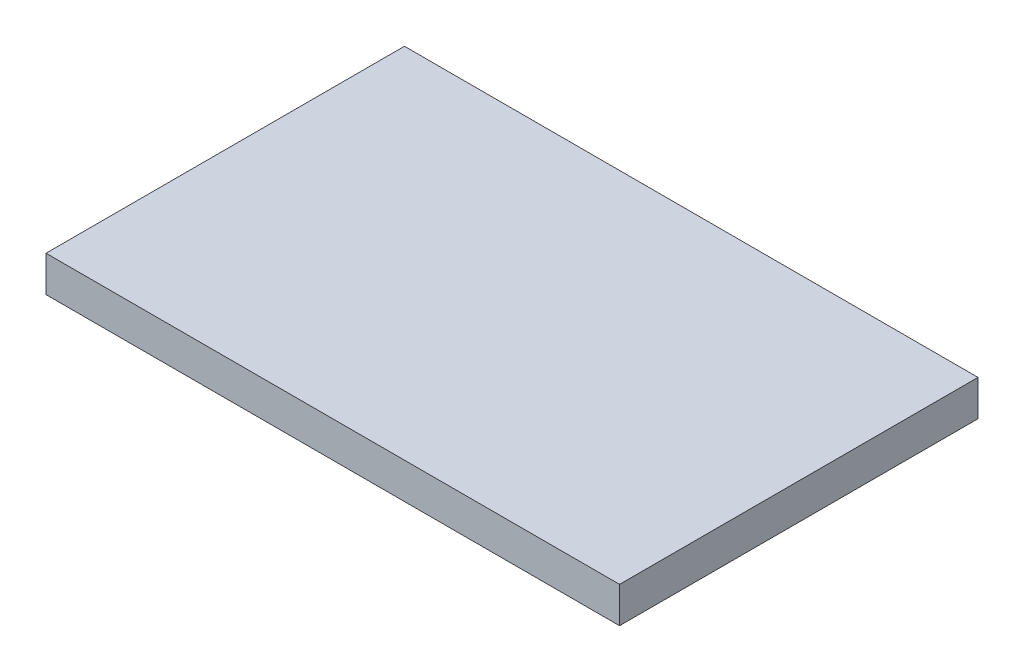
ISO-10303-21;
HEADER;
FILE_DESCRIPTION(('STEP AP214'),'2;1');
FILE_NAME('part.step','',(''),(''),'','','');
FILE_SCHEMA(('AUTOMOTIVE_DESIGN { 1 0 10303 214 1 1 1 1 }'));
ENDSEC;
DATA;
#1=APPLICATION_CONTEXT('core data for automotive mechanical design processes');
#2=APPLICATION_PROTOCOL_DEFINITION('international standard','automotive_design',2000,#1);
#3=PRODUCT_CONTEXT('',#1,'mechanical');
#4=PRODUCT('Part','Part','',(#3));
#5=PRODUCT_RELATED_PRODUCT_CATEGORY('part','',(#4));
#6=PRODUCT_DEFINITION_FORMATION('','',#4);
#7=PRODUCT_DEFINITION_CONTEXT('part definition',#1,'design');
#8=PRODUCT_DEFINITION('design','',#6,#7);
#9=PRODUCT_DEFINITION_SHAPE('','',#8);
#10=(LENGTH_UNIT() NAMED_UNIT(*) SI_UNIT(.MILLI.,.METRE.));
#11=(NAMED_UNIT(*) PLANE_ANGLE_UNIT() SI_UNIT($,.RADIAN.));
#12=(NAMED_UNIT(*) SI_UNIT($,.STERADIAN.) SOLID_ANGLE_UNIT());
#13=UNCERTAINTY_MEASURE_WITH_UNIT(LENGTH_MEASURE(1.E-05),#10,'distance_accuracy_value','');
#14=(GEOMETRIC_REPRESENTATION_CONTEXT(3) GLOBAL_UNCERTAINTY_ASSIGNED_CONTEXT((#13)) GLOBAL_UNIT_ASSIGNED_CONTEXT((#10,
#11,#12)) REPRESENTATION_CONTEXT('',''));
#15=CARTESIAN_POINT('',(0.,0.,0.));
#16=DIRECTION('',(0.,0.,1.));
#17=DIRECTION('',(1.,0.,0.));
#18=AXIS2_PLACEMENT_3D('',#15,#16,#17);
#19=CARTESIAN_POINT('',(0.,-12.7,127.));
#20=DIRECTION('',(1.,0.,0.));
#21=DIRECTION('',(0.,0.,-1.));
#22=AXIS2_PLACEMENT_3D('',#19,#20,#21);
#23=PLANE('',#22);
#24=DIRECTION('',(0.,-1.,0.));
#25=VECTOR('',#24,1.);
#26=CARTESIAN_POINT('',(0.,-12.7,0.));
#27=LINE('',#26,#25);
#28=CARTESIAN_POINT('',(0.,0.,0.));
#29=VERTEX_POINT('',#28);
#30=CARTESIAN_POINT('',(0.,-12.7,0.));
#31=VERTEX_POINT('',#30);
#32=EDGE_CURVE('E107',#29,#31,#27,.T.);
#33=ORIENTED_EDGE('',*,*,#32,.T.);
#34=DIRECTION('',(0.,0.,-1.));
#35=VECTOR('',#34,1.);
#36=CARTESIAN_POINT('',(0.,-12.7,127.));
#37=LINE('',#36,#35);
#38=CARTESIAN_POINT('',(0.,-12.7,127.));
#39=VERTEX_POINT('',#38);
#40=EDGE_CURVE('E11',#39,#31,#37,.T.);
#41=ORIENTED_EDGE('',*,*,#40,.F.);
#42=DIRECTION('',(0.,-1.,0.));
#43=VECTOR('',#42,1.);
#44=CARTESIAN_POINT('',(0.,-12.7,127.));
#45=LINE('',#44,#43);
#46=CARTESIAN_POINT('',(0.,0.,127.));
#47=VERTEX_POINT('',#46);
#48=EDGE_CURVE('E91',#47,#39,#45,.T.);
#49=ORIENTED_EDGE('',*,*,#48,.F.);
#50=DIRECTION('',(0.,0.,-1.));
#51=VECTOR('',#50,1.);
#52=CARTESIAN_POINT('',(0.,0.,127.));
#53=LINE('',#52,#51);
#54=EDGE_CURVE('E103',#47,#29,#53,.T.);
#55=ORIENTED_EDGE('',*,*,#54,.T.);
#56=EDGE_LOOP('',(#33,#41,#49,#55));
#57=FACE_BOUND('',#56,.T.);
#58=ADVANCED_FACE('F39',(#57),#23,.F.);
#59=CARTESIAN_POINT('',(203.2,-12.7,127.));
#60=DIRECTION('',(0.,1.,0.));
#61=DIRECTION('',(-1.,0.,0.));
#62=AXIS2_PLACEMENT_3D('',#59,#60,#61);
#63=PLANE('',#62);
#64=DIRECTION('',(1.,0.,0.));
#65=VECTOR('',#64,1.);
#66=CARTESIAN_POINT('',(203.2,-12.7,0.));
#67=LINE('',#66,#65);
#68=CARTESIAN_POINT('',(203.2,-12.7,0.));
#69=VERTEX_POINT('',#68);
#70=EDGE_CURVE('E96',#31,#69,#67,.T.);
#71=ORIENTED_EDGE('',*,*,#70,.T.);
#72=DIRECTION('',(0.,0.,-1.));
#73=VECTOR('',#72,1.);
#74=CARTESIAN_POINT('',(203.2,-12.7,127.));
#75=LINE('',#74,#73);
#76=CARTESIAN_POINT('',(203.2,-12.7,127.));
#77=VERTEX_POINT('',#76);
#78=EDGE_CURVE('E48',#77,#69,#75,.T.);
#79=ORIENTED_EDGE('',*,*,#78,.F.);
#80=DIRECTION('',(1.,0.,0.));
#81=VECTOR('',#80,1.);
#82=CARTESIAN_POINT('',(203.2,-12.7,127.));
#83=LINE('',#82,#81);
#84=EDGE_CURVE('E86',#39,#77,#83,.T.);
#85=ORIENTED_EDGE('',*,*,#84,.F.);
#86=ORIENTED_EDGE('',*,*,#40,.T.);
#87=EDGE_LOOP('',(#71,#79,#85,#86));
#88=FACE_BOUND('',#87,.T.);
#89=ADVANCED_FACE('F95',(#88),#63,.F.);
#90=CARTESIAN_POINT('',(203.2,0.,127.));
#91=DIRECTION('',(-1.,0.,0.));
#92=DIRECTION('',(0.,0.,1.));
#93=AXIS2_PLACEMENT_3D('',#90,#91,#92);
#94=PLANE('',#93);
#95=DIRECTION('',(0.,1.,0.));
#96=VECTOR('',#95,1.);
#97=CARTESIAN_POINT('',(203.2,0.,0.));
#98=LINE('',#97,#96);
#99=CARTESIAN_POINT('',(203.2,0.,0.));
#100=VERTEX_POINT('',#99);
#101=EDGE_CURVE('E73',#69,#100,#98,.T.);
#102=ORIENTED_EDGE('',*,*,#101,.T.);
#103=DIRECTION('',(0.,0.,-1.));
#104=VECTOR('',#103,1.);
#105=CARTESIAN_POINT('',(203.2,0.,127.));
#106=LINE('',#105,#104);
#107=CARTESIAN_POINT('',(203.2,0.,127.));
#108=VERTEX_POINT('',#107);
#109=EDGE_CURVE('E98',#108,#100,#106,.T.);
#110=ORIENTED_EDGE('',*,*,#109,.F.);
#111=DIRECTION('',(0.,1.,0.));
#112=VECTOR('',#111,1.);
#113=CARTESIAN_POINT('',(203.2,0.,127.));
#114=LINE('',#113,#112);
#115=EDGE_CURVE('E89',#77,#108,#114,.T.);
#116=ORIENTED_EDGE('',*,*,#115,.F.);
#117=ORIENTED_EDGE('',*,*,#78,.T.);
#118=EDGE_LOOP('',(#102,#110,#116,#117));
#119=FACE_BOUND('',#118,.T.);
#120=ADVANCED_FACE('F99',(#119),#94,.F.);
#121=CARTESIAN_POINT('',(0.,0.,127.));
#122=DIRECTION('',(0.,-1.,0.));
#123=DIRECTION('',(0.,0.,-1.));
#124=AXIS2_PLACEMENT_3D('',#121,#122,#123);
#125=PLANE('',#124);
#126=DIRECTION('',(-1.,0.,0.));
#127=VECTOR('',#126,1.);
#128=CARTESIAN_POINT('',(0.,0.,0.));
#129=LINE('',#128,#127);
#130=EDGE_CURVE('E79',#100,#29,#129,.T.);
#131=ORIENTED_EDGE('',*,*,#130,.T.);
#132=ORIENTED_EDGE('',*,*,#54,.F.);
#133=DIRECTION('',(-1.,0.,0.));
#134=VECTOR('',#133,1.);
#135=CARTESIAN_POINT('',(0.,0.,127.));
#136=LINE('',#135,#134);
#137=EDGE_CURVE('E56',#108,#47,#136,.T.);
#138=ORIENTED_EDGE('',*,*,#137,.F.);
#139=ORIENTED_EDGE('',*,*,#109,.T.);
#140=EDGE_LOOP('',(#131,#132,#138,#139));
#141=FACE_BOUND('',#140,.T.);
#142=ADVANCED_FACE('F120',(#141),#125,.F.);
#143=CARTESIAN_POINT('',(0.,0.,127.));
#144=DIRECTION('',(0.,0.,-1.));
#145=DIRECTION('',(-1.,0.,0.));
#146=AXIS2_PLACEMENT_3D('',#143,#144,#145);
#147=PLANE('',#146);
#148=ORIENTED_EDGE('',*,*,#48,.T.);
#149=ORIENTED_EDGE('',*,*,#84,.T.);
#150=ORIENTED_EDGE('',*,*,#115,.T.);
#151=ORIENTED_EDGE('',*,*,#137,.T.);
#152=EDGE_LOOP('',(#148,#149,#150,#151));
#153=FACE_BOUND('',#152,.T.);
#154=ADVANCED_FACE('F87',(#153),#147,.F.);
#155=CARTESIAN_POINT('',(0.,0.,0.));
#156=DIRECTION('',(0.,0.,-1.));
#157=DIRECTION('',(-1.,0.,0.));
#158=AXIS2_PLACEMENT_3D('',#155,#156,#157);
#159=PLANE('',#158);
#160=ORIENTED_EDGE('',*,*,#32,.F.);
#161=ORIENTED_EDGE('',*,*,#130,.F.);
#162=ORIENTED_EDGE('',*,*,#101,.F.);
#163=ORIENTED_EDGE('',*,*,#70,.F.);
#164=EDGE_LOOP('',(#160,#161,#162,#163));
#165=FACE_BOUND('',#164,.T.);
#166=ADVANCED_FACE('F123',(#165),#159,.T.);
#167=CLOSED_SHELL('',(#58,#89,#120,#142,#154,#166));
#168=MANIFOLD_SOLID_BREP('B2',#167);
#169=ADVANCED_BREP_SHAPE_REPRESENTATION('',(#18,#168),#14);
#170=SHAPE_DEFINITION_REPRESENTATION(#9,#169);
ENDSEC;
END-ISO-10303-21;
